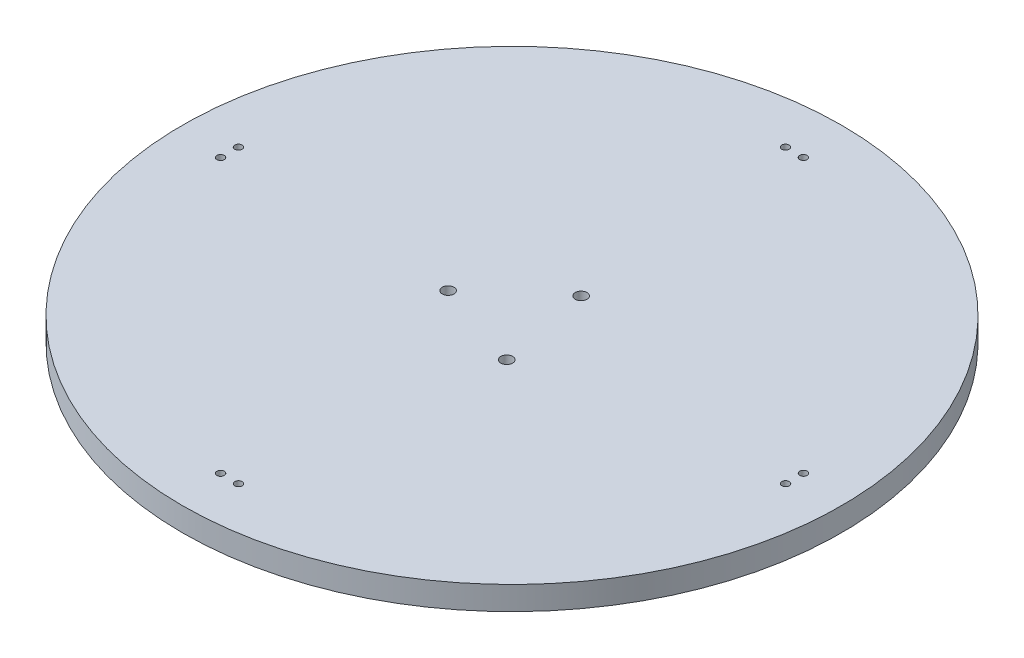
ISO-10303-21;
HEADER;
FILE_DESCRIPTION(('STEP AP214'),'2;1');
FILE_NAME('part.step','',(''),(''),'','','');
FILE_SCHEMA(('AUTOMOTIVE_DESIGN { 1 0 10303 214 1 1 1 1 }'));
ENDSEC;
DATA;
#1=APPLICATION_CONTEXT('core data for automotive mechanical design processes');
#2=APPLICATION_PROTOCOL_DEFINITION('international standard','automotive_design',2000,#1);
#3=PRODUCT_CONTEXT('',#1,'mechanical');
#4=PRODUCT('Part','Part','',(#3));
#5=PRODUCT_RELATED_PRODUCT_CATEGORY('part','',(#4));
#6=PRODUCT_DEFINITION_FORMATION('','',#4);
#7=PRODUCT_DEFINITION_CONTEXT('part definition',#1,'design');
#8=PRODUCT_DEFINITION('design','',#6,#7);
#9=PRODUCT_DEFINITION_SHAPE('','',#8);
#10=(LENGTH_UNIT() NAMED_UNIT(*) SI_UNIT(.MILLI.,.METRE.));
#11=(NAMED_UNIT(*) PLANE_ANGLE_UNIT() SI_UNIT($,.RADIAN.));
#12=(NAMED_UNIT(*) SI_UNIT($,.STERADIAN.) SOLID_ANGLE_UNIT());
#13=UNCERTAINTY_MEASURE_WITH_UNIT(LENGTH_MEASURE(1.E-05),#10,'distance_accuracy_value','');
#14=(GEOMETRIC_REPRESENTATION_CONTEXT(3) GLOBAL_UNCERTAINTY_ASSIGNED_CONTEXT((#13)) GLOBAL_UNIT_ASSIGNED_CONTEXT((#10,
#11,#12)) REPRESENTATION_CONTEXT('',''));
#15=CARTESIAN_POINT('',(0.,0.,0.));
#16=DIRECTION('',(0.,0.,1.));
#17=DIRECTION('',(1.,0.,0.));
#18=AXIS2_PLACEMENT_3D('',#15,#16,#17);
#19=CARTESIAN_POINT('',(0.,6.35,0.));
#20=DIRECTION('',(0.,-1.,0.));
#21=DIRECTION('',(0.,0.,-1.));
#22=AXIS2_PLACEMENT_3D('',#19,#20,#21);
#23=CYLINDRICAL_SURFACE('',#22,88.9);
#24=CARTESIAN_POINT('',(0.,6.35,0.));
#25=DIRECTION('',(0.,1.,0.));
#26=DIRECTION('',(0.,0.,1.));
#27=AXIS2_PLACEMENT_3D('',#24,#25,#26);
#28=CIRCLE('',#27,88.9);
#29=CARTESIAN_POINT('',(0.,6.35,88.9));
#30=VERTEX_POINT('',#29);
#31=EDGE_CURVE('E12',#30,#30,#28,.T.);
#32=ORIENTED_EDGE('',*,*,#31,.F.);
#33=EDGE_LOOP('',(#32));
#34=FACE_BOUND('',#33,.T.);
#35=CARTESIAN_POINT('',(0.,0.,0.));
#36=DIRECTION('',(0.,1.,0.));
#37=DIRECTION('',(0.,0.,1.));
#38=AXIS2_PLACEMENT_3D('',#35,#36,#37);
#39=CIRCLE('',#38,88.9);
#40=CARTESIAN_POINT('',(0.,0.,88.9));
#41=VERTEX_POINT('',#40);
#42=EDGE_CURVE('E48',#41,#41,#39,.T.);
#43=ORIENTED_EDGE('',*,*,#42,.T.);
#44=EDGE_LOOP('',(#43));
#45=FACE_BOUND('',#44,.T.);
#46=ADVANCED_FACE('F45',(#34,#45),#23,.T.);
#47=CARTESIAN_POINT('',(0.,6.35,0.));
#48=DIRECTION('',(0.,1.,0.));
#49=DIRECTION('',(0.,0.,1.));
#50=AXIS2_PLACEMENT_3D('',#47,#48,#49);
#51=PLANE('',#50);
#52=CARTESIAN_POINT('',(4.76683913949143,6.35,-13.8857797065275));
#53=DIRECTION('',(0.,1.,0.));
#54=DIRECTION('',(0.,0.,1.));
#55=AXIS2_PLACEMENT_3D('',#52,#53,#54);
#56=CIRCLE('',#55,1.58750000004361);
#57=CARTESIAN_POINT('',(4.76683913949143,6.35,-12.2982797064839));
#58=VERTEX_POINT('',#57);
#59=EDGE_CURVE('E117',#58,#58,#56,.F.);
#60=ORIENTED_EDGE('',*,*,#59,.T.);
#61=EDGE_LOOP('',(#60));
#62=FACE_BOUND('',#61,.T.);
#63=CARTESIAN_POINT('',(-14.408857546953,6.35,2.81468606271022));
#64=DIRECTION('',(0.,1.,0.));
#65=DIRECTION('',(0.,0.,1.));
#66=AXIS2_PLACEMENT_3D('',#63,#64,#65);
#67=CIRCLE('',#66,1.58750000004361);
#68=CARTESIAN_POINT('',(-14.408857546953,6.35,4.40218606275382));
#69=VERTEX_POINT('',#68);
#70=EDGE_CURVE('E111',#69,#69,#67,.F.);
#71=ORIENTED_EDGE('',*,*,#70,.T.);
#72=EDGE_LOOP('',(#71));
#73=FACE_BOUND('',#72,.T.);
#74=CARTESIAN_POINT('',(9.64201840746155,6.35,11.0710936438173));
#75=DIRECTION('',(0.,1.,0.));
#76=DIRECTION('',(0.,0.,1.));
#77=AXIS2_PLACEMENT_3D('',#74,#75,#76);
#78=CIRCLE('',#77,1.58750000004361);
#79=CARTESIAN_POINT('',(9.64201840746155,6.35,12.6585936438609));
#80=VERTEX_POINT('',#79);
#81=EDGE_CURVE('E105',#80,#80,#78,.F.);
#82=ORIENTED_EDGE('',*,*,#81,.T.);
#83=EDGE_LOOP('',(#82));
#84=FACE_BOUND('',#83,.T.);
#85=CARTESIAN_POINT('',(76.2,6.35,-2.42528547571793));
#86=DIRECTION('',(0.,1.,0.));
#87=DIRECTION('',(0.,0.,1.));
#88=AXIS2_PLACEMENT_3D('',#85,#86,#87);
#89=CIRCLE('',#88,0.999999999999998);
#90=CARTESIAN_POINT('',(76.2,6.35,-1.42528547571793));
#91=VERTEX_POINT('',#90);
#92=EDGE_CURVE('E63',#91,#91,#89,.F.);
#93=ORIENTED_EDGE('',*,*,#92,.T.);
#94=EDGE_LOOP('',(#93));
#95=FACE_BOUND('',#94,.T.);
#96=CARTESIAN_POINT('',(76.2,6.35,2.41167793524643));
#97=DIRECTION('',(0.,1.,0.));
#98=DIRECTION('',(0.,0.,1.));
#99=AXIS2_PLACEMENT_3D('',#96,#97,#98);
#100=CIRCLE('',#99,0.999999999999998);
#101=CARTESIAN_POINT('',(76.2,6.35,3.41167793524642));
#102=VERTEX_POINT('',#101);
#103=EDGE_CURVE('E70',#102,#102,#100,.F.);
#104=ORIENTED_EDGE('',*,*,#103,.T.);
#105=EDGE_LOOP('',(#104));
#106=FACE_BOUND('',#105,.T.);
#107=CARTESIAN_POINT('',(2.42528547571794,6.35,76.2));
#108=DIRECTION('',(0.,1.,0.));
#109=DIRECTION('',(0.,0.,1.));
#110=AXIS2_PLACEMENT_3D('',#107,#108,#109);
#111=CIRCLE('',#110,1.);
#112=CARTESIAN_POINT('',(2.42528547571794,6.35,77.2));
#113=VERTEX_POINT('',#112);
#114=EDGE_CURVE('E76',#113,#113,#111,.F.);
#115=ORIENTED_EDGE('',*,*,#114,.T.);
#116=EDGE_LOOP('',(#115));
#117=FACE_BOUND('',#116,.T.);
#118=CARTESIAN_POINT('',(-2.41167793524642,6.35,76.2));
#119=DIRECTION('',(0.,1.,0.));
#120=DIRECTION('',(0.,0.,1.));
#121=AXIS2_PLACEMENT_3D('',#118,#119,#120);
#122=CIRCLE('',#121,1.);
#123=CARTESIAN_POINT('',(-2.41167793524642,6.35,77.2));
#124=VERTEX_POINT('',#123);
#125=EDGE_CURVE('E82',#124,#124,#122,.F.);
#126=ORIENTED_EDGE('',*,*,#125,.T.);
#127=EDGE_LOOP('',(#126));
#128=FACE_BOUND('',#127,.T.);
#129=CARTESIAN_POINT('',(-76.2,6.35,2.42528547571794));
#130=DIRECTION('',(0.,1.,0.));
#131=DIRECTION('',(0.,0.,1.));
#132=AXIS2_PLACEMENT_3D('',#129,#130,#131);
#133=CIRCLE('',#132,0.999999999999998);
#134=CARTESIAN_POINT('',(-76.2,6.35,3.42528547571794));
#135=VERTEX_POINT('',#134);
#136=EDGE_CURVE('E88',#135,#135,#133,.F.);
#137=ORIENTED_EDGE('',*,*,#136,.T.);
#138=EDGE_LOOP('',(#137));
#139=FACE_BOUND('',#138,.T.);
#140=CARTESIAN_POINT('',(-76.2,6.35,-2.41167793524642));
#141=DIRECTION('',(0.,1.,0.));
#142=DIRECTION('',(0.,0.,1.));
#143=AXIS2_PLACEMENT_3D('',#140,#141,#142);
#144=CIRCLE('',#143,0.999999999999998);
#145=CARTESIAN_POINT('',(-76.2,6.35,-1.41167793524642));
#146=VERTEX_POINT('',#145);
#147=EDGE_CURVE('E94',#146,#146,#144,.F.);
#148=ORIENTED_EDGE('',*,*,#147,.T.);
#149=EDGE_LOOP('',(#148));
#150=FACE_BOUND('',#149,.T.);
#151=CARTESIAN_POINT('',(-2.42528547571795,6.35,-76.2));
#152=DIRECTION('',(0.,1.,0.));
#153=DIRECTION('',(0.,0.,1.));
#154=AXIS2_PLACEMENT_3D('',#151,#152,#153);
#155=CIRCLE('',#154,1.);
#156=CARTESIAN_POINT('',(-2.42528547571795,6.35,-75.2));
#157=VERTEX_POINT('',#156);
#158=EDGE_CURVE('E100',#157,#157,#155,.F.);
#159=ORIENTED_EDGE('',*,*,#158,.T.);
#160=EDGE_LOOP('',(#159));
#161=FACE_BOUND('',#160,.T.);
#162=CARTESIAN_POINT('',(2.41167793524641,6.35,-76.2));
#163=DIRECTION('',(0.,1.,0.));
#164=DIRECTION('',(0.,0.,1.));
#165=AXIS2_PLACEMENT_3D('',#162,#163,#164);
#166=CIRCLE('',#165,1.);
#167=CARTESIAN_POINT('',(2.41167793524641,6.35,-75.2));
#168=VERTEX_POINT('',#167);
#169=EDGE_CURVE('E57',#168,#168,#166,.F.);
#170=ORIENTED_EDGE('',*,*,#169,.T.);
#171=EDGE_LOOP('',(#170));
#172=FACE_BOUND('',#171,.T.);
#173=ORIENTED_EDGE('',*,*,#31,.T.);
#174=EDGE_LOOP('',(#173));
#175=FACE_BOUND('',#174,.T.);
#176=ADVANCED_FACE('F129',(#62,#73,#84,#95,#106,#117,#128,#139,#150,#161,#172,#175),#51,.T.);
#177=CARTESIAN_POINT('',(0.,0.,0.));
#178=DIRECTION('',(0.,1.,0.));
#179=DIRECTION('',(0.,0.,1.));
#180=AXIS2_PLACEMENT_3D('',#177,#178,#179);
#181=PLANE('',#180);
#182=CARTESIAN_POINT('',(4.76683913949143,0.,-13.8857797065275));
#183=DIRECTION('',(0.,-1.,0.));
#184=DIRECTION('',(0.,0.,-1.));
#185=AXIS2_PLACEMENT_3D('',#182,#183,#184);
#186=CIRCLE('',#185,1.58750000004361);
#187=CARTESIAN_POINT('',(4.76683913949143,0.,-15.4732797065711));
#188=VERTEX_POINT('',#187);
#189=EDGE_CURVE('E67',#188,#188,#186,.T.);
#190=ORIENTED_EDGE('',*,*,#189,.F.);
#191=EDGE_LOOP('',(#190));
#192=FACE_BOUND('',#191,.T.);
#193=CARTESIAN_POINT('',(-14.408857546953,0.,2.81468606271022));
#194=DIRECTION('',(0.,-1.,0.));
#195=DIRECTION('',(0.,0.,-1.));
#196=AXIS2_PLACEMENT_3D('',#193,#194,#195);
#197=CIRCLE('',#196,1.58750000004361);
#198=CARTESIAN_POINT('',(-14.408857546953,0.,1.22718606266661));
#199=VERTEX_POINT('',#198);
#200=EDGE_CURVE('E114',#199,#199,#197,.T.);
#201=ORIENTED_EDGE('',*,*,#200,.F.);
#202=EDGE_LOOP('',(#201));
#203=FACE_BOUND('',#202,.T.);
#204=CARTESIAN_POINT('',(9.64201840746155,0.,11.0710936438173));
#205=DIRECTION('',(0.,-1.,0.));
#206=DIRECTION('',(0.,0.,-1.));
#207=AXIS2_PLACEMENT_3D('',#204,#205,#206);
#208=CIRCLE('',#207,1.58750000004361);
#209=CARTESIAN_POINT('',(9.64201840746155,0.,9.4835936437737));
#210=VERTEX_POINT('',#209);
#211=EDGE_CURVE('E108',#210,#210,#208,.T.);
#212=ORIENTED_EDGE('',*,*,#211,.F.);
#213=EDGE_LOOP('',(#212));
#214=FACE_BOUND('',#213,.T.);
#215=CARTESIAN_POINT('',(76.2,0.,-2.42528547571793));
#216=DIRECTION('',(0.,-1.,0.));
#217=DIRECTION('',(0.,0.,-1.));
#218=AXIS2_PLACEMENT_3D('',#215,#216,#217);
#219=CIRCLE('',#218,0.999999999999998);
#220=CARTESIAN_POINT('',(76.2,0.,-3.42528547571793));
#221=VERTEX_POINT('',#220);
#222=EDGE_CURVE('E66',#221,#221,#219,.T.);
#223=ORIENTED_EDGE('',*,*,#222,.F.);
#224=EDGE_LOOP('',(#223));
#225=FACE_BOUND('',#224,.T.);
#226=CARTESIAN_POINT('',(76.2,0.,2.41167793524643));
#227=DIRECTION('',(0.,-1.,0.));
#228=DIRECTION('',(0.,0.,-1.));
#229=AXIS2_PLACEMENT_3D('',#226,#227,#228);
#230=CIRCLE('',#229,0.999999999999998);
#231=CARTESIAN_POINT('',(76.2,0.,1.41167793524643));
#232=VERTEX_POINT('',#231);
#233=EDGE_CURVE('E73',#232,#232,#230,.T.);
#234=ORIENTED_EDGE('',*,*,#233,.F.);
#235=EDGE_LOOP('',(#234));
#236=FACE_BOUND('',#235,.T.);
#237=CARTESIAN_POINT('',(2.42528547571794,0.,76.2));
#238=DIRECTION('',(0.,-1.,0.));
#239=DIRECTION('',(0.,0.,-1.));
#240=AXIS2_PLACEMENT_3D('',#237,#238,#239);
#241=CIRCLE('',#240,1.);
#242=CARTESIAN_POINT('',(2.42528547571794,0.,75.2));
#243=VERTEX_POINT('',#242);
#244=EDGE_CURVE('E79',#243,#243,#241,.T.);
#245=ORIENTED_EDGE('',*,*,#244,.F.);
#246=EDGE_LOOP('',(#245));
#247=FACE_BOUND('',#246,.T.);
#248=CARTESIAN_POINT('',(-2.41167793524642,0.,76.2));
#249=DIRECTION('',(0.,-1.,0.));
#250=DIRECTION('',(0.,0.,-1.));
#251=AXIS2_PLACEMENT_3D('',#248,#249,#250);
#252=CIRCLE('',#251,1.);
#253=CARTESIAN_POINT('',(-2.41167793524642,0.,75.2));
#254=VERTEX_POINT('',#253);
#255=EDGE_CURVE('E85',#254,#254,#252,.T.);
#256=ORIENTED_EDGE('',*,*,#255,.F.);
#257=EDGE_LOOP('',(#256));
#258=FACE_BOUND('',#257,.T.);
#259=CARTESIAN_POINT('',(-76.2,0.,2.42528547571794));
#260=DIRECTION('',(0.,-1.,0.));
#261=DIRECTION('',(0.,0.,-1.));
#262=AXIS2_PLACEMENT_3D('',#259,#260,#261);
#263=CIRCLE('',#262,0.999999999999998);
#264=CARTESIAN_POINT('',(-76.2,0.,1.42528547571794));
#265=VERTEX_POINT('',#264);
#266=EDGE_CURVE('E91',#265,#265,#263,.T.);
#267=ORIENTED_EDGE('',*,*,#266,.F.);
#268=EDGE_LOOP('',(#267));
#269=FACE_BOUND('',#268,.T.);
#270=CARTESIAN_POINT('',(-76.2,0.,-2.41167793524642));
#271=DIRECTION('',(0.,-1.,0.));
#272=DIRECTION('',(0.,0.,-1.));
#273=AXIS2_PLACEMENT_3D('',#270,#271,#272);
#274=CIRCLE('',#273,0.999999999999998);
#275=CARTESIAN_POINT('',(-76.2,0.,-3.41167793524642));
#276=VERTEX_POINT('',#275);
#277=EDGE_CURVE('E97',#276,#276,#274,.T.);
#278=ORIENTED_EDGE('',*,*,#277,.F.);
#279=EDGE_LOOP('',(#278));
#280=FACE_BOUND('',#279,.T.);
#281=CARTESIAN_POINT('',(-2.42528547571795,0.,-76.2));
#282=DIRECTION('',(0.,-1.,0.));
#283=DIRECTION('',(0.,0.,-1.));
#284=AXIS2_PLACEMENT_3D('',#281,#282,#283);
#285=CIRCLE('',#284,1.);
#286=CARTESIAN_POINT('',(-2.42528547571795,0.,-77.2));
#287=VERTEX_POINT('',#286);
#288=EDGE_CURVE('E60',#287,#287,#285,.T.);
#289=ORIENTED_EDGE('',*,*,#288,.F.);
#290=EDGE_LOOP('',(#289));
#291=FACE_BOUND('',#290,.T.);
#292=CARTESIAN_POINT('',(2.41167793524641,0.,-76.2));
#293=DIRECTION('',(0.,-1.,0.));
#294=DIRECTION('',(0.,0.,-1.));
#295=AXIS2_PLACEMENT_3D('',#292,#293,#294);
#296=CIRCLE('',#295,1.);
#297=CARTESIAN_POINT('',(2.41167793524641,0.,-77.2));
#298=VERTEX_POINT('',#297);
#299=EDGE_CURVE('E55',#298,#298,#296,.T.);
#300=ORIENTED_EDGE('',*,*,#299,.F.);
#301=EDGE_LOOP('',(#300));
#302=FACE_BOUND('',#301,.T.);
#303=ORIENTED_EDGE('',*,*,#42,.F.);
#304=EDGE_LOOP('',(#303));
#305=FACE_BOUND('',#304,.T.);
#306=ADVANCED_FACE('F125',(#192,#203,#214,#225,#236,#247,#258,#269,#280,#291,#302,#305),#181,.F.);
#307=CARTESIAN_POINT('',(2.41167793524641,6.351,-76.2));
#308=DIRECTION('',(0.,-1.,0.));
#309=DIRECTION('',(0.,0.,-1.));
#310=AXIS2_PLACEMENT_3D('',#307,#308,#309);
#311=CYLINDRICAL_SURFACE('',#310,1.);
#312=ORIENTED_EDGE('',*,*,#169,.F.);
#313=EDGE_LOOP('',(#312));
#314=FACE_BOUND('',#313,.T.);
#315=ORIENTED_EDGE('',*,*,#299,.T.);
#316=EDGE_LOOP('',(#315));
#317=FACE_BOUND('',#316,.T.);
#318=ADVANCED_FACE('F128',(#314,#317),#311,.F.);
#319=CARTESIAN_POINT('',(-2.42528547571795,6.351,-76.2));
#320=DIRECTION('',(0.,-1.,0.));
#321=DIRECTION('',(0.,0.,-1.));
#322=AXIS2_PLACEMENT_3D('',#319,#320,#321);
#323=CYLINDRICAL_SURFACE('',#322,1.);
#324=ORIENTED_EDGE('',*,*,#158,.F.);
#325=EDGE_LOOP('',(#324));
#326=FACE_BOUND('',#325,.T.);
#327=ORIENTED_EDGE('',*,*,#288,.T.);
#328=EDGE_LOOP('',(#327));
#329=FACE_BOUND('',#328,.T.);
#330=ADVANCED_FACE('F165',(#326,#329),#323,.F.);
#331=CARTESIAN_POINT('',(-76.2,6.351,-2.41167793524642));
#332=DIRECTION('',(0.,-1.,0.));
#333=DIRECTION('',(0.,0.,-1.));
#334=AXIS2_PLACEMENT_3D('',#331,#332,#333);
#335=CYLINDRICAL_SURFACE('',#334,0.999999999999998);
#336=ORIENTED_EDGE('',*,*,#147,.F.);
#337=EDGE_LOOP('',(#336));
#338=FACE_BOUND('',#337,.T.);
#339=ORIENTED_EDGE('',*,*,#277,.T.);
#340=EDGE_LOOP('',(#339));
#341=FACE_BOUND('',#340,.T.);
#342=ADVANCED_FACE('F187',(#338,#341),#335,.F.);
#343=CARTESIAN_POINT('',(-76.2,6.351,2.42528547571794));
#344=DIRECTION('',(0.,-1.,0.));
#345=DIRECTION('',(0.,0.,-1.));
#346=AXIS2_PLACEMENT_3D('',#343,#344,#345);
#347=CYLINDRICAL_SURFACE('',#346,0.999999999999998);
#348=ORIENTED_EDGE('',*,*,#136,.F.);
#349=EDGE_LOOP('',(#348));
#350=FACE_BOUND('',#349,.T.);
#351=ORIENTED_EDGE('',*,*,#266,.T.);
#352=EDGE_LOOP('',(#351));
#353=FACE_BOUND('',#352,.T.);
#354=ADVANCED_FACE('F183',(#350,#353),#347,.F.);
#355=CARTESIAN_POINT('',(-2.41167793524642,6.351,76.2));
#356=DIRECTION('',(0.,-1.,0.));
#357=DIRECTION('',(0.,0.,-1.));
#358=AXIS2_PLACEMENT_3D('',#355,#356,#357);
#359=CYLINDRICAL_SURFACE('',#358,1.);
#360=ORIENTED_EDGE('',*,*,#125,.F.);
#361=EDGE_LOOP('',(#360));
#362=FACE_BOUND('',#361,.T.);
#363=ORIENTED_EDGE('',*,*,#255,.T.);
#364=EDGE_LOOP('',(#363));
#365=FACE_BOUND('',#364,.T.);
#366=ADVANCED_FACE('F179',(#362,#365),#359,.F.);
#367=CARTESIAN_POINT('',(2.42528547571794,6.351,76.2));
#368=DIRECTION('',(0.,-1.,0.));
#369=DIRECTION('',(0.,0.,-1.));
#370=AXIS2_PLACEMENT_3D('',#367,#368,#369);
#371=CYLINDRICAL_SURFACE('',#370,1.);
#372=ORIENTED_EDGE('',*,*,#114,.F.);
#373=EDGE_LOOP('',(#372));
#374=FACE_BOUND('',#373,.T.);
#375=ORIENTED_EDGE('',*,*,#244,.T.);
#376=EDGE_LOOP('',(#375));
#377=FACE_BOUND('',#376,.T.);
#378=ADVANCED_FACE('F175',(#374,#377),#371,.F.);
#379=CARTESIAN_POINT('',(76.2,6.351,2.41167793524643));
#380=DIRECTION('',(0.,-1.,0.));
#381=DIRECTION('',(0.,0.,-1.));
#382=AXIS2_PLACEMENT_3D('',#379,#380,#381);
#383=CYLINDRICAL_SURFACE('',#382,0.999999999999998);
#384=ORIENTED_EDGE('',*,*,#103,.F.);
#385=EDGE_LOOP('',(#384));
#386=FACE_BOUND('',#385,.T.);
#387=ORIENTED_EDGE('',*,*,#233,.T.);
#388=EDGE_LOOP('',(#387));
#389=FACE_BOUND('',#388,.T.);
#390=ADVANCED_FACE('F171',(#386,#389),#383,.F.);
#391=CARTESIAN_POINT('',(76.2,6.351,-2.42528547571793));
#392=DIRECTION('',(0.,-1.,0.));
#393=DIRECTION('',(0.,0.,-1.));
#394=AXIS2_PLACEMENT_3D('',#391,#392,#393);
#395=CYLINDRICAL_SURFACE('',#394,0.999999999999998);
#396=ORIENTED_EDGE('',*,*,#92,.F.);
#397=EDGE_LOOP('',(#396));
#398=FACE_BOUND('',#397,.T.);
#399=ORIENTED_EDGE('',*,*,#222,.T.);
#400=EDGE_LOOP('',(#399));
#401=FACE_BOUND('',#400,.T.);
#402=ADVANCED_FACE('F167',(#398,#401),#395,.F.);
#403=CARTESIAN_POINT('',(9.64201840746155,6.351,11.0710936438173));
#404=DIRECTION('',(0.,-1.,0.));
#405=DIRECTION('',(0.,0.,-1.));
#406=AXIS2_PLACEMENT_3D('',#403,#404,#405);
#407=CYLINDRICAL_SURFACE('',#406,1.58750000004361);
#408=ORIENTED_EDGE('',*,*,#81,.F.);
#409=EDGE_LOOP('',(#408));
#410=FACE_BOUND('',#409,.T.);
#411=ORIENTED_EDGE('',*,*,#211,.T.);
#412=EDGE_LOOP('',(#411));
#413=FACE_BOUND('',#412,.T.);
#414=ADVANCED_FACE('F170',(#410,#413),#407,.F.);
#415=CARTESIAN_POINT('',(-14.408857546953,6.351,2.81468606271022));
#416=DIRECTION('',(0.,-1.,0.));
#417=DIRECTION('',(0.,0.,-1.));
#418=AXIS2_PLACEMENT_3D('',#415,#416,#417);
#419=CYLINDRICAL_SURFACE('',#418,1.58750000004361);
#420=ORIENTED_EDGE('',*,*,#70,.F.);
#421=EDGE_LOOP('',(#420));
#422=FACE_BOUND('',#421,.T.);
#423=ORIENTED_EDGE('',*,*,#200,.T.);
#424=EDGE_LOOP('',(#423));
#425=FACE_BOUND('',#424,.T.);
#426=ADVANCED_FACE('F197',(#422,#425),#419,.F.);
#427=CARTESIAN_POINT('',(4.76683913949143,6.351,-13.8857797065275));
#428=DIRECTION('',(0.,-1.,0.));
#429=DIRECTION('',(0.,0.,-1.));
#430=AXIS2_PLACEMENT_3D('',#427,#428,#429);
#431=CYLINDRICAL_SURFACE('',#430,1.58750000004361);
#432=ORIENTED_EDGE('',*,*,#59,.F.);
#433=EDGE_LOOP('',(#432));
#434=FACE_BOUND('',#433,.T.);
#435=ORIENTED_EDGE('',*,*,#189,.T.);
#436=EDGE_LOOP('',(#435));
#437=FACE_BOUND('',#436,.T.);
#438=ADVANCED_FACE('F123',(#434,#437),#431,.F.);
#439=CLOSED_SHELL('',(#46,#176,#306,#318,#330,#342,#354,#366,#378,#390,#402,#414,#426,#438));
#440=MANIFOLD_SOLID_BREP('B2',#439);
#441=ADVANCED_BREP_SHAPE_REPRESENTATION('',(#18,#440),#14);
#442=SHAPE_DEFINITION_REPRESENTATION(#9,#441);
ENDSEC;
END-ISO-10303-21;
